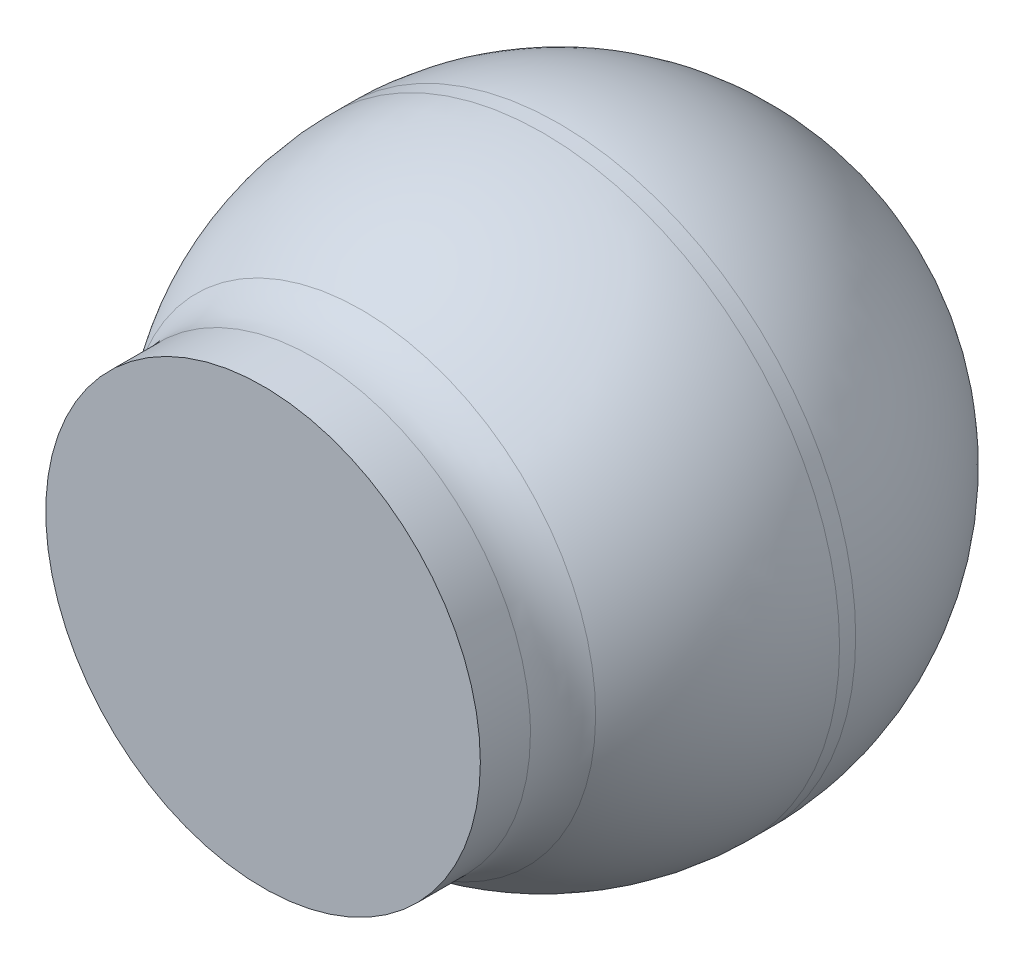
ISO-10303-21;
HEADER;
FILE_DESCRIPTION(('STEP AP214'),'2;1');
FILE_NAME('part.step','',(''),(''),'','','');
FILE_SCHEMA(('AUTOMOTIVE_DESIGN { 1 0 10303 214 1 1 1 1 }'));
ENDSEC;
DATA;
#1=APPLICATION_CONTEXT('core data for automotive mechanical design processes');
#2=APPLICATION_PROTOCOL_DEFINITION('international standard','automotive_design',2000,#1);
#3=PRODUCT_CONTEXT('',#1,'mechanical');
#4=PRODUCT('Part','Part','',(#3));
#5=PRODUCT_RELATED_PRODUCT_CATEGORY('part','',(#4));
#6=PRODUCT_DEFINITION_FORMATION('','',#4);
#7=PRODUCT_DEFINITION_CONTEXT('part definition',#1,'design');
#8=PRODUCT_DEFINITION('design','',#6,#7);
#9=PRODUCT_DEFINITION_SHAPE('','',#8);
#10=(LENGTH_UNIT() NAMED_UNIT(*) SI_UNIT(.MILLI.,.METRE.));
#11=(NAMED_UNIT(*) PLANE_ANGLE_UNIT() SI_UNIT($,.RADIAN.));
#12=(NAMED_UNIT(*) SI_UNIT($,.STERADIAN.) SOLID_ANGLE_UNIT());
#13=UNCERTAINTY_MEASURE_WITH_UNIT(LENGTH_MEASURE(1.E-05),#10,'distance_accuracy_value','');
#14=(GEOMETRIC_REPRESENTATION_CONTEXT(3) GLOBAL_UNCERTAINTY_ASSIGNED_CONTEXT((#13)) GLOBAL_UNIT_ASSIGNED_CONTEXT((#10,
#11,#12)) REPRESENTATION_CONTEXT('',''));
#15=CARTESIAN_POINT('',(0.,0.,0.));
#16=DIRECTION('',(0.,0.,1.));
#17=DIRECTION('',(1.,0.,0.));
#18=AXIS2_PLACEMENT_3D('',#15,#16,#17);
#19=CARTESIAN_POINT('',(-3.102919922269,-7.861349291452,10.006534503384));
#20=DIRECTION('',(0.,0.,-1.));
#21=DIRECTION('',(-1.,0.,0.));
#22=AXIS2_PLACEMENT_3D('',#19,#20,#21);
#23=PLANE('',#22);
#24=CARTESIAN_POINT('',(-3.102919922269,-7.861349291452,10.006534503384));
#25=DIRECTION('',(0.,0.,1.));
#26=DIRECTION('',(1.,0.,0.));
#27=AXIS2_PLACEMENT_3D('',#24,#25,#26);
#28=CIRCLE('',#27,0.275);
#29=CARTESIAN_POINT('',(-2.827919922269,-7.861349291452,10.006534503384));
#30=VERTEX_POINT('',#29);
#31=EDGE_CURVE('E20',#30,#30,#28,.F.);
#32=ORIENTED_EDGE('',*,*,#31,.F.);
#33=EDGE_LOOP('',(#32));
#34=FACE_BOUND('',#33,.T.);
#35=ADVANCED_FACE('F17',(#34),#23,.F.);
#36=CARTESIAN_POINT('',(-3.102919922269,-7.861349291452,9.906534503384));
#37=DIRECTION('',(0.,0.,1.));
#38=DIRECTION('',(1.,0.,0.));
#39=AXIS2_PLACEMENT_3D('',#36,#37,#38);
#40=CYLINDRICAL_SURFACE('',#39,0.275);
#41=CARTESIAN_POINT('',(-3.102919922269,-7.861349291452,9.943180457728));
#42=DIRECTION('',(0.,0.,-1.));
#43=DIRECTION('',(0.996700902337582,0.081162252799247,0.));
#44=AXIS2_PLACEMENT_3D('',#41,#42,#43);
#45=CIRCLE('',#44,0.275);
#46=CARTESIAN_POINT('',(-2.82882717412616,-7.83902967193221,9.943180457728));
#47=VERTEX_POINT('',#46);
#48=EDGE_CURVE('E65',#47,#47,#45,.F.);
#49=ORIENTED_EDGE('',*,*,#48,.T.);
#50=EDGE_LOOP('',(#49));
#51=FACE_BOUND('',#50,.T.);
#52=ORIENTED_EDGE('',*,*,#31,.T.);
#53=EDGE_LOOP('',(#52));
#54=FACE_BOUND('',#53,.T.);
#55=ADVANCED_FACE('F62',(#51,#54),#40,.T.);
#56=CARTESIAN_POINT('',(-3.102919922269,-7.861349291452,9.943180457728));
#57=DIRECTION('',(0.,0.,-1.));
#58=DIRECTION('',(0.996700902337583,0.0811622527992448,0.));
#59=AXIS2_PLACEMENT_3D('',#56,#57,#58);
#60=TOROIDAL_SURFACE('',#59,0.375,0.1);
#61=ORIENTED_EDGE('',*,*,#48,.F.);
#62=EDGE_LOOP('',(#61));
#63=FACE_BOUND('',#62,.T.);
#64=CARTESIAN_POINT('',(-3.102919922269,-7.861349291452,9.881744931236));
#65=DIRECTION('',(0.,0.,-1.));
#66=DIRECTION('',(-0.996700902337598,-0.0811622527990621,0.));
#67=AXIS2_PLACEMENT_3D('',#64,#65,#66);
#68=CIRCLE('',#67,0.296097046412665);
#69=CARTESIAN_POINT('',(-3.398040115608,-7.885381194786,9.881744931236));
#70=VERTEX_POINT('',#69);
#71=EDGE_CURVE('E39',#70,#70,#68,.T.);
#72=ORIENTED_EDGE('',*,*,#71,.F.);
#73=EDGE_LOOP('',(#72));
#74=FACE_BOUND('',#73,.T.);
#75=ADVANCED_FACE('F57',(#63,#74),#60,.F.);
#76=CARTESIAN_POINT('',(-3.476682760645,-7.891785136252,9.651976062157));
#77=CARTESIAN_POINT('',(-3.476682760645,-7.891785136252,9.701461392103));
#78=CARTESIAN_POINT('',(-3.468526217348,-7.891120941579,9.750947004335));
#79=CARTESIAN_POINT('',(-3.452207085349,-7.889792059952,9.798626332798));
#80=CARTESIAN_POINT('',(-3.428341390838,-7.887848654938,9.842699544317));
#81=CARTESIAN_POINT('',(-3.398040115608,-7.885381194786,9.881744931236));
#82=(BOUNDED_CURVE() B_SPLINE_CURVE(5,(#76,#77,#78,#79,#80,#81),.UNSPECIFIED.,.F.,
.F.) B_SPLINE_CURVE_WITH_KNOTS((6,6),(0.,0.661568582165),
.UNSPECIFIED.) CURVE() GEOMETRIC_REPRESENTATION_ITEM() RATIONAL_B_SPLINE_CURVE((1.,1.,1.,1.,1.,1.)) REPRESENTATION_ITEM(''));
#83=CARTESIAN_POINT('',(-3.102919922269,-7.861349291452,9.651976062157));
#84=DIRECTION('',(0.,0.,-1.));
#85=AXIS1_PLACEMENT('',#83,#84);
#86=SURFACE_OF_REVOLUTION('',#82,#85);
#87=CARTESIAN_POINT('',(-3.102919922269,-7.861349291452,9.651976062157));
#88=DIRECTION('',(0.,0.,1.));
#89=DIRECTION('',(1.,0.,0.));
#90=AXIS2_PLACEMENT_3D('',#87,#88,#89);
#91=CIRCLE('',#90,0.375);
#92=CARTESIAN_POINT('',(-2.727919922269,-7.861349291452,9.651976062157));
#93=VERTEX_POINT('',#92);
#94=EDGE_CURVE('E36',#93,#93,#91,.F.);
#95=ORIENTED_EDGE('',*,*,#94,.F.);
#96=EDGE_LOOP('',(#95));
#97=FACE_BOUND('',#96,.T.);
#98=ORIENTED_EDGE('',*,*,#71,.T.);
#99=EDGE_LOOP('',(#98));
#100=FACE_BOUND('',#99,.T.);
#101=ADVANCED_FACE('F53',(#97,#100),#86,.F.);
#102=CARTESIAN_POINT('',(-3.102919922269,-7.861349291452,9.256534503384));
#103=DIRECTION('',(0.,0.,1.));
#104=DIRECTION('',(1.,0.,0.));
#105=AXIS2_PLACEMENT_3D('',#102,#103,#104);
#106=CYLINDRICAL_SURFACE('',#105,0.375);
#107=CARTESIAN_POINT('',(-3.102919922269,-7.861349291452,9.631534503384));
#108=DIRECTION('',(0.,0.,-1.));
#109=DIRECTION('',(0.0811622527992357,-0.996700902337583,0.));
#110=AXIS2_PLACEMENT_3D('',#107,#108,#109);
#111=CIRCLE('',#110,0.375);
#112=CARTESIAN_POINT('',(-3.07248407746929,-8.23511212982859,9.631534503384));
#113=VERTEX_POINT('',#112);
#114=CARTESIAN_POINT('',(-3.13335576706871,-7.48758645307541,9.631534503384));
#115=VERTEX_POINT('',#114);
#116=EDGE_CURVE('E11',#113,#115,#111,.T.);
#117=ORIENTED_EDGE('',*,*,#116,.F.);
#118=CARTESIAN_POINT('',(-3.102919922269,-7.861349291452,9.631534503384));
#119=DIRECTION('',(0.,0.,1.));
#120=DIRECTION('',(0.0811622527992365,-0.996700902337583,0.));
#121=AXIS2_PLACEMENT_3D('',#118,#119,#120);
#122=CIRCLE('',#121,0.375);
#123=EDGE_CURVE('E25',#115,#113,#122,.F.);
#124=ORIENTED_EDGE('',*,*,#123,.F.);
#125=EDGE_LOOP('',(#117,#124));
#126=FACE_BOUND('',#125,.T.);
#127=ORIENTED_EDGE('',*,*,#94,.T.);
#128=EDGE_LOOP('',(#127));
#129=FACE_BOUND('',#128,.T.);
#130=ADVANCED_FACE('F34',(#126,#129),#106,.T.);
#131=CARTESIAN_POINT('',(-3.102919922269,-7.861349291452,9.631534503384));
#132=DIRECTION('',(0.0811622527992361,-0.996700902337583,0.));
#133=DIRECTION('',(-0.996700902337583,-0.0811622527992361,0.));
#134=AXIS2_PLACEMENT_3D('',#131,#132,#133);
#135=SPHERICAL_SURFACE('',#134,0.375);
#136=ORIENTED_EDGE('',*,*,#123,.T.);
#137=ORIENTED_EDGE('',*,*,#116,.T.);
#138=EDGE_LOOP('',(#136,#137));
#139=FACE_BOUND('',#138,.T.);
#140=ADVANCED_FACE('F32',(#139),#135,.T.);
#141=CLOSED_SHELL('',(#35,#55,#75,#101,#130,#140));
#142=MANIFOLD_SOLID_BREP('B1',#141);
#143=ADVANCED_BREP_SHAPE_REPRESENTATION('',(#18,#142),#14);
#144=SHAPE_DEFINITION_REPRESENTATION(#9,#143);
ENDSEC;
END-ISO-10303-21;
